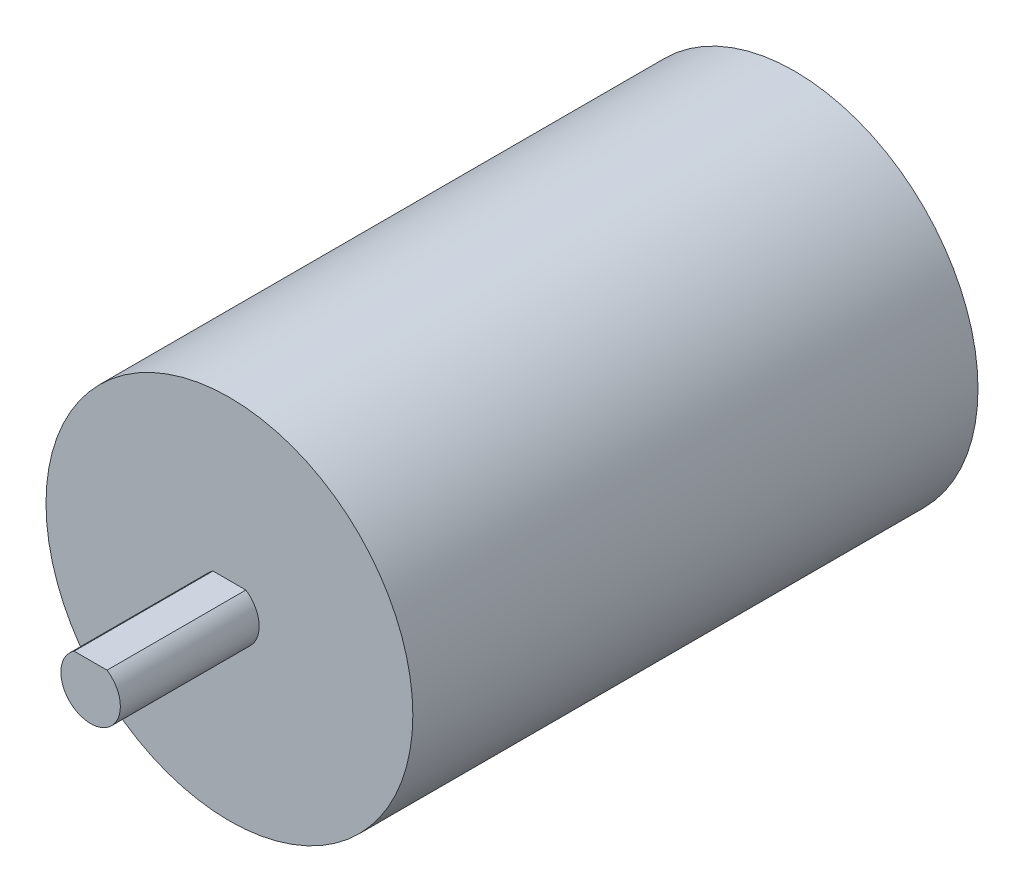
ISO-10303-21;
HEADER;
FILE_DESCRIPTION(('STEP AP214'),'2;1');
FILE_NAME('part.step','',(''),(''),'','','');
FILE_SCHEMA(('AUTOMOTIVE_DESIGN { 1 0 10303 214 1 1 1 1 }'));
ENDSEC;
DATA;
#1=APPLICATION_CONTEXT('core data for automotive mechanical design processes');
#2=APPLICATION_PROTOCOL_DEFINITION('international standard','automotive_design',2000,#1);
#3=PRODUCT_CONTEXT('',#1,'mechanical');
#4=PRODUCT('Part','Part','',(#3));
#5=PRODUCT_RELATED_PRODUCT_CATEGORY('part','',(#4));
#6=PRODUCT_DEFINITION_FORMATION('','',#4);
#7=PRODUCT_DEFINITION_CONTEXT('part definition',#1,'design');
#8=PRODUCT_DEFINITION('design','',#6,#7);
#9=PRODUCT_DEFINITION_SHAPE('','',#8);
#10=(LENGTH_UNIT() NAMED_UNIT(*) SI_UNIT(.MILLI.,.METRE.));
#11=(NAMED_UNIT(*) PLANE_ANGLE_UNIT() SI_UNIT($,.RADIAN.));
#12=(NAMED_UNIT(*) SI_UNIT($,.STERADIAN.) SOLID_ANGLE_UNIT());
#13=UNCERTAINTY_MEASURE_WITH_UNIT(LENGTH_MEASURE(1.E-05),#10,'distance_accuracy_value','');
#14=(GEOMETRIC_REPRESENTATION_CONTEXT(3) GLOBAL_UNCERTAINTY_ASSIGNED_CONTEXT((#13)) GLOBAL_UNIT_ASSIGNED_CONTEXT((#10,
#11,#12)) REPRESENTATION_CONTEXT('',''));
#15=CARTESIAN_POINT('',(0.,0.,0.));
#16=DIRECTION('',(0.,0.,1.));
#17=DIRECTION('',(1.,0.,0.));
#18=AXIS2_PLACEMENT_3D('',#15,#16,#17);
#19=CARTESIAN_POINT('',(0.,0.,57.));
#20=DIRECTION('',(0.,0.,1.));
#21=DIRECTION('',(1.,0.,0.));
#22=AXIS2_PLACEMENT_3D('',#19,#20,#21);
#23=PLANE('',#22);
#24=CARTESIAN_POINT('',(0.,0.,57.));
#25=DIRECTION('',(0.,0.,1.));
#26=DIRECTION('',(1.,0.,0.));
#27=AXIS2_PLACEMENT_3D('',#24,#25,#26);
#28=CIRCLE('',#27,18.5);
#29=CARTESIAN_POINT('',(18.5,0.,57.));
#30=VERTEX_POINT('',#29);
#31=EDGE_CURVE('E11',#30,#30,#28,.T.);
#32=ORIENTED_EDGE('',*,*,#31,.T.);
#33=EDGE_LOOP('',(#32));
#34=FACE_BOUND('',#33,.T.);
#35=DIRECTION('',(1.,0.,0.));
#36=VECTOR('',#35,1.);
#37=CARTESIAN_POINT('',(0.,2.5,57.));
#38=LINE('',#37,#36);
#39=CARTESIAN_POINT('',(-1.6583123951777,2.5,57.));
#40=VERTEX_POINT('',#39);
#41=CARTESIAN_POINT('',(1.6583123951777,2.5,57.));
#42=VERTEX_POINT('',#41);
#43=EDGE_CURVE('E48',#40,#42,#38,.T.);
#44=ORIENTED_EDGE('',*,*,#43,.T.);
#45=CARTESIAN_POINT('',(0.,0.,57.));
#46=DIRECTION('',(0.,0.,1.));
#47=DIRECTION('',(1.,0.,0.));
#48=AXIS2_PLACEMENT_3D('',#45,#46,#47);
#49=CIRCLE('',#48,3.);
#50=EDGE_CURVE('E69',#40,#42,#49,.T.);
#51=ORIENTED_EDGE('',*,*,#50,.F.);
#52=EDGE_LOOP('',(#44,#51));
#53=FACE_BOUND('',#52,.T.);
#54=ADVANCED_FACE('F33',(#34,#53),#23,.T.);
#55=CARTESIAN_POINT('',(0.,0.,57.));
#56=DIRECTION('',(0.,0.,-1.));
#57=DIRECTION('',(-1.,0.,0.));
#58=AXIS2_PLACEMENT_3D('',#55,#56,#57);
#59=CYLINDRICAL_SURFACE('',#58,18.5);
#60=ORIENTED_EDGE('',*,*,#31,.F.);
#61=EDGE_LOOP('',(#60));
#62=FACE_BOUND('',#61,.T.);
#63=CARTESIAN_POINT('',(0.,0.,0.));
#64=DIRECTION('',(0.,0.,1.));
#65=DIRECTION('',(1.,0.,0.));
#66=AXIS2_PLACEMENT_3D('',#63,#64,#65);
#67=CIRCLE('',#66,18.5);
#68=CARTESIAN_POINT('',(18.5,0.,0.));
#69=VERTEX_POINT('',#68);
#70=EDGE_CURVE('E37',#69,#69,#67,.T.);
#71=ORIENTED_EDGE('',*,*,#70,.T.);
#72=EDGE_LOOP('',(#71));
#73=FACE_BOUND('',#72,.T.);
#74=ADVANCED_FACE('F35',(#62,#73),#59,.T.);
#75=CARTESIAN_POINT('',(0.,0.,0.));
#76=DIRECTION('',(0.,0.,1.));
#77=DIRECTION('',(1.,0.,0.));
#78=AXIS2_PLACEMENT_3D('',#75,#76,#77);
#79=PLANE('',#78);
#80=ORIENTED_EDGE('',*,*,#70,.F.);
#81=EDGE_LOOP('',(#80));
#82=FACE_BOUND('',#81,.T.);
#83=ADVANCED_FACE('F81',(#82),#79,.F.);
#84=CARTESIAN_POINT('',(0.,2.5,71.));
#85=DIRECTION('',(0.,1.,0.));
#86=DIRECTION('',(0.,0.,1.));
#87=AXIS2_PLACEMENT_3D('',#84,#85,#86);
#88=PLANE('',#87);
#89=ORIENTED_EDGE('',*,*,#43,.F.);
#90=DIRECTION('',(0.,0.,-1.));
#91=VECTOR('',#90,1.);
#92=CARTESIAN_POINT('',(-1.6583123951777,2.5,71.));
#93=LINE('',#92,#91);
#94=CARTESIAN_POINT('',(-1.6583123951777,2.5,71.));
#95=VERTEX_POINT('',#94);
#96=EDGE_CURVE('E66',#95,#40,#93,.T.);
#97=ORIENTED_EDGE('',*,*,#96,.F.);
#98=DIRECTION('',(1.,0.,0.));
#99=VECTOR('',#98,1.);
#100=CARTESIAN_POINT('',(0.,2.5,71.));
#101=LINE('',#100,#99);
#102=CARTESIAN_POINT('',(1.6583123951777,2.5,71.));
#103=VERTEX_POINT('',#102);
#104=EDGE_CURVE('E64',#95,#103,#101,.T.);
#105=ORIENTED_EDGE('',*,*,#104,.T.);
#106=DIRECTION('',(0.,0.,-1.));
#107=VECTOR('',#106,1.);
#108=CARTESIAN_POINT('',(1.6583123951777,2.5,71.));
#109=LINE('',#108,#107);
#110=EDGE_CURVE('E61',#103,#42,#109,.T.);
#111=ORIENTED_EDGE('',*,*,#110,.T.);
#112=EDGE_LOOP('',(#89,#97,#105,#111));
#113=FACE_BOUND('',#112,.T.);
#114=ADVANCED_FACE('F63',(#113),#88,.T.);
#115=CARTESIAN_POINT('',(0.,0.,71.));
#116=DIRECTION('',(0.,0.,-1.));
#117=DIRECTION('',(-1.,0.,0.));
#118=AXIS2_PLACEMENT_3D('',#115,#116,#117);
#119=CYLINDRICAL_SURFACE('',#118,3.);
#120=ORIENTED_EDGE('',*,*,#50,.T.);
#121=ORIENTED_EDGE('',*,*,#110,.F.);
#122=CARTESIAN_POINT('',(0.,0.,71.));
#123=DIRECTION('',(0.,0.,1.));
#124=DIRECTION('',(1.,0.,0.));
#125=AXIS2_PLACEMENT_3D('',#122,#123,#124);
#126=CIRCLE('',#125,3.);
#127=EDGE_CURVE('E56',#95,#103,#126,.T.);
#128=ORIENTED_EDGE('',*,*,#127,.F.);
#129=ORIENTED_EDGE('',*,*,#96,.T.);
#130=EDGE_LOOP('',(#120,#121,#128,#129));
#131=FACE_BOUND('',#130,.T.);
#132=ADVANCED_FACE('F70',(#131),#119,.T.);
#133=CARTESIAN_POINT('',(0.,0.,71.));
#134=DIRECTION('',(0.,0.,1.));
#135=DIRECTION('',(1.,0.,0.));
#136=AXIS2_PLACEMENT_3D('',#133,#134,#135);
#137=PLANE('',#136);
#138=ORIENTED_EDGE('',*,*,#104,.F.);
#139=ORIENTED_EDGE('',*,*,#127,.T.);
#140=EDGE_LOOP('',(#138,#139));
#141=FACE_BOUND('',#140,.T.);
#142=ADVANCED_FACE('F97',(#141),#137,.T.);
#143=CLOSED_SHELL('',(#54,#74,#83,#114,#132,#142));
#144=MANIFOLD_SOLID_BREP('B2',#143);
#145=ADVANCED_BREP_SHAPE_REPRESENTATION('',(#18,#144),#14);
#146=SHAPE_DEFINITION_REPRESENTATION(#9,#145);
ENDSEC;
END-ISO-10303-21;
